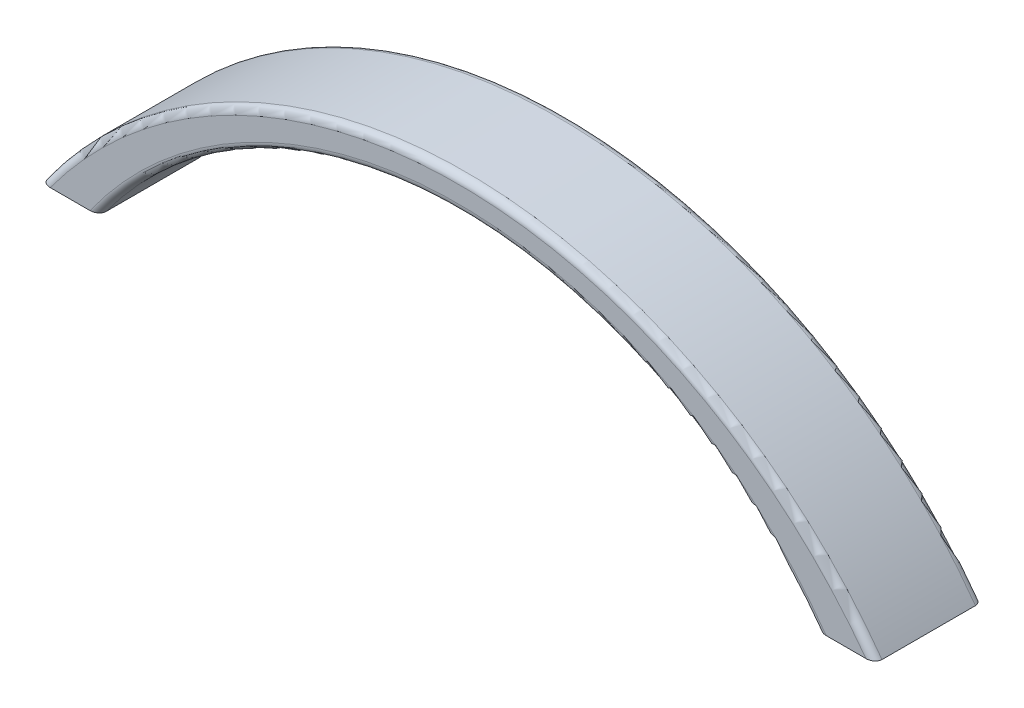
ISO-10303-21;
HEADER;
FILE_DESCRIPTION(('STEP AP214'),'2;1');
FILE_NAME('part.step','',(''),(''),'','','');
FILE_SCHEMA(('AUTOMOTIVE_DESIGN { 1 0 10303 214 1 1 1 1 }'));
ENDSEC;
DATA;
#1=APPLICATION_CONTEXT('core data for automotive mechanical design processes');
#2=APPLICATION_PROTOCOL_DEFINITION('international standard','automotive_design',2000,#1);
#3=PRODUCT_CONTEXT('',#1,'mechanical');
#4=PRODUCT('Part','Part','',(#3));
#5=PRODUCT_RELATED_PRODUCT_CATEGORY('part','',(#4));
#6=PRODUCT_DEFINITION_FORMATION('','',#4);
#7=PRODUCT_DEFINITION_CONTEXT('part definition',#1,'design');
#8=PRODUCT_DEFINITION('design','',#6,#7);
#9=PRODUCT_DEFINITION_SHAPE('','',#8);
#10=(LENGTH_UNIT() NAMED_UNIT(*) SI_UNIT(.MILLI.,.METRE.));
#11=(NAMED_UNIT(*) PLANE_ANGLE_UNIT() SI_UNIT($,.RADIAN.));
#12=(NAMED_UNIT(*) SI_UNIT($,.STERADIAN.) SOLID_ANGLE_UNIT());
#13=UNCERTAINTY_MEASURE_WITH_UNIT(LENGTH_MEASURE(1.E-05),#10,'distance_accuracy_value','');
#14=(GEOMETRIC_REPRESENTATION_CONTEXT(3) GLOBAL_UNCERTAINTY_ASSIGNED_CONTEXT((#13)) GLOBAL_UNIT_ASSIGNED_CONTEXT((#10,
#11,#12)) REPRESENTATION_CONTEXT('',''));
#15=CARTESIAN_POINT('',(0.,0.,0.));
#16=DIRECTION('',(0.,0.,1.));
#17=DIRECTION('',(1.,0.,0.));
#18=AXIS2_PLACEMENT_3D('',#15,#16,#17);
#19=CARTESIAN_POINT('',(0.,-36.3967136150236,15.));
#20=DIRECTION('',(0.,0.,-1.));
#21=DIRECTION('',(-1.,0.,0.));
#22=AXIS2_PLACEMENT_3D('',#19,#20,#21);
#23=CYLINDRICAL_SURFACE('',#22,61.8443268374234);
#24=DIRECTION('',(0.,0.,-1.));
#25=VECTOR('',#24,1.);
#26=CARTESIAN_POINT('',(-50.,0.,15.));
#27=LINE('',#26,#25);
#28=CARTESIAN_POINT('',(-50.,0.,14.));
#29=VERTEX_POINT('',#28);
#30=CARTESIAN_POINT('',(-50.,0.,1.));
#31=VERTEX_POINT('',#30);
#32=EDGE_CURVE('E219',#29,#31,#27,.T.);
#33=ORIENTED_EDGE('',*,*,#32,.T.);
#34=CARTESIAN_POINT('',(0.,-36.3967136150236,1.));
#35=DIRECTION('',(0.,0.,-1.));
#36=DIRECTION('',(-1.,0.,0.));
#37=AXIS2_PLACEMENT_3D('',#34,#35,#36);
#38=CIRCLE('',#37,61.8443268374234);
#39=CARTESIAN_POINT('',(50.,0.,1.));
#40=VERTEX_POINT('',#39);
#41=EDGE_CURVE('E119',#31,#40,#38,.T.);
#42=ORIENTED_EDGE('',*,*,#41,.T.);
#43=DIRECTION('',(0.,0.,-1.));
#44=VECTOR('',#43,1.);
#45=CARTESIAN_POINT('',(50.,0.,15.));
#46=LINE('',#45,#44);
#47=CARTESIAN_POINT('',(50.,0.,14.));
#48=VERTEX_POINT('',#47);
#49=EDGE_CURVE('E103',#48,#40,#46,.T.);
#50=ORIENTED_EDGE('',*,*,#49,.F.);
#51=CARTESIAN_POINT('',(0.,-36.3967136150236,14.));
#52=DIRECTION('',(0.,0.,-1.));
#53=DIRECTION('',(-1.,0.,0.));
#54=AXIS2_PLACEMENT_3D('',#51,#52,#53);
#55=CIRCLE('',#54,61.8443268374234);
#56=EDGE_CURVE('E116',#48,#29,#55,.F.);
#57=ORIENTED_EDGE('',*,*,#56,.T.);
#58=EDGE_LOOP('',(#33,#42,#50,#57));
#59=FACE_BOUND('',#58,.T.);
#60=ADVANCED_FACE('F33',(#59),#23,.F.);
#61=CARTESIAN_POINT('',(50.,0.,15.));
#62=DIRECTION('',(0.,1.,0.));
#63=DIRECTION('',(-1.,0.,0.));
#64=AXIS2_PLACEMENT_3D('',#61,#62,#63);
#65=PLANE('',#64);
#66=ORIENTED_EDGE('',*,*,#49,.T.);
#67=CARTESIAN_POINT('',(50.,0.,1.));
#68=CARTESIAN_POINT('',(49.9999973303354,0.,0.975656117454124));
#69=CARTESIAN_POINT('',(50.0011004083956,0.,0.951325680612658));
#70=CARTESIAN_POINT('',(50.0054817249724,0.,0.902872884445946));
#71=CARTESIAN_POINT('',(50.0087589228829,0.,0.878750431165487));
#72=CARTESIAN_POINT('',(50.0217417247559,0.,0.80724619009343));
#73=CARTESIAN_POINT('',(50.0345996266479,0.,0.760403301098637));
#74=CARTESIAN_POINT('',(50.0679520751676,0.,0.669660913790851));
#75=CARTESIAN_POINT('',(50.0884350861074,0.,0.625757086877651));
#76=CARTESIAN_POINT('',(50.1360216281653,0.,0.541655603501701));
#77=CARTESIAN_POINT('',(50.1631335109511,0.,0.501462711113891));
#78=CARTESIAN_POINT('',(50.2249309833848,0.,0.422778706721437));
#79=CARTESIAN_POINT('',(50.2600120677553,0.,0.384600162044744));
#80=CARTESIAN_POINT('',(50.3351768897337,0.,0.313576106327075));
#81=CARTESIAN_POINT('',(50.3752618565199,0.,0.280731910218845));
#82=CARTESIAN_POINT('',(50.467026549603,0.,0.214992146734737));
#83=CARTESIAN_POINT('',(50.5194859604133,0.,0.183186128162649));
#84=CARTESIAN_POINT('',(50.6283551876696,0.,0.127211462005206));
#85=CARTESIAN_POINT('',(50.684769337654,0.,0.103051357676763));
#86=CARTESIAN_POINT('',(50.8111668957454,0.,0.0584711953695335));
#87=CARTESIAN_POINT('',(50.8817024755066,0.,0.0396164530205002));
#88=CARTESIAN_POINT('',(51.0246834154305,0.,0.0125232794636211));
#89=CARTESIAN_POINT('',(51.0971259681558,0.,0.0042700449595866));
#90=CARTESIAN_POINT('',(51.1903798190438,0.,0.000425739631521767));
#91=CARTESIAN_POINT('',(51.2110511926059,0.,1.21973844565116E-07));
#92=CARTESIAN_POINT('',(51.2317153106828,0.,0.));
#93=B_SPLINE_CURVE_WITH_KNOTS('',3,(#67,#68,#69,#70,#71,#72,#73,#74,#75,#76,#77,#78,#79,#80,#81,
#82,#83,#84,#85,#86,#87,#88,#89,#90,#91,#92),.UNSPECIFIED.,.F.,.F.,(4,2,2,2,2,2,2,2,2,2,2,2,4),
(0.,0.0729807791682395,0.145926652486109,0.290859667092715,0.435574304215737,0.580472214365173,
0.735443548170114,0.890453025078733,1.07381667770554,1.25738449644889,1.47558133069051,
1.69347315585304,1.75548084937669),.UNSPECIFIED.);
#94=CARTESIAN_POINT('',(51.2317153106828,0.,0.));
#95=VERTEX_POINT('',#94);
#96=EDGE_CURVE('E110',#40,#95,#93,.T.);
#97=ORIENTED_EDGE('',*,*,#96,.T.);
#98=DIRECTION('',(1.,0.,0.));
#99=VECTOR('',#98,1.);
#100=CARTESIAN_POINT('',(50.,0.,0.));
#101=LINE('',#100,#99);
#102=CARTESIAN_POINT('',(56.7657879567442,0.,0.));
#103=VERTEX_POINT('',#102);
#104=EDGE_CURVE('E199',#95,#103,#101,.T.);
#105=ORIENTED_EDGE('',*,*,#104,.T.);
#106=CARTESIAN_POINT('',(56.7657879567442,0.,0.));
#107=CARTESIAN_POINT('',(56.8503936718824,0.,1.87937669883942E-05));
#108=CARTESIAN_POINT('',(56.9351617328932,0.,0.00700431566945534));
#109=CARTESIAN_POINT('',(57.1027645540088,0.,0.0352733980871163));
#110=CARTESIAN_POINT('',(57.1855852603745,0.,0.0566395985893962));
#111=CARTESIAN_POINT('',(57.3318141922752,0.,0.108968350539189));
#112=CARTESIAN_POINT('',(57.3960661303273,0.,0.137567119214284));
#113=CARTESIAN_POINT('',(57.5189433983722,0.,0.204830031545095));
#114=CARTESIAN_POINT('',(57.5775835800715,0.,0.243466541837695));
#115=CARTESIAN_POINT('',(57.6769651245512,0.,0.322791148161954));
#116=CARTESIAN_POINT('',(57.7190220972949,0.,0.361828038141967));
#117=CARTESIAN_POINT('',(57.7962254955942,0.,0.44631668782979));
#118=CARTESIAN_POINT('',(57.8313705389152,0.,0.49176972751165));
#119=CARTESIAN_POINT('',(57.8931837161221,0.,0.588728915541138));
#120=CARTESIAN_POINT('',(57.9197751107167,0.,0.640284476607118));
#121=CARTESIAN_POINT('',(57.9621894882547,0.,0.747611083078497));
#122=CARTESIAN_POINT('',(57.9780397464968,0.,0.803371048493074));
#123=CARTESIAN_POINT('',(57.9919221854008,0.,0.883190223559995));
#124=CARTESIAN_POINT('',(57.9949472283301,0.,0.906456659470983));
#125=CARTESIAN_POINT('',(57.9989852341919,0.,0.953143520093479));
#126=CARTESIAN_POINT('',(57.9999998961424,0.,0.976563797978172));
#127=CARTESIAN_POINT('',(58.0000000000002,0.,0.999999999999966));
#128=B_SPLINE_CURVE_WITH_KNOTS('',3,(#106,#107,#108,#109,#110,#111,#112,#113,#114,#115,#116,
#117,#118,#119,#120,#121,#122,#123,#124,#125,#126,#127),.UNSPECIFIED.,.F.,.F.,(4,2,2,2,2,2,2,2,
2,2,4),(0.,0.253811426040733,0.509094000667615,0.719253361415208,0.928840184863864,
1.10030794301184,1.27180995616909,1.44481026414552,1.61736960422303,1.68768458782042,
1.75794012126249),.UNSPECIFIED.);
#129=CARTESIAN_POINT('',(58.,0.,1.));
#130=VERTEX_POINT('',#129);
#131=EDGE_CURVE('E126',#103,#130,#128,.T.);
#132=ORIENTED_EDGE('',*,*,#131,.T.);
#133=DIRECTION('',(0.,0.,-1.));
#134=VECTOR('',#133,1.);
#135=CARTESIAN_POINT('',(58.,0.,15.));
#136=LINE('',#135,#134);
#137=CARTESIAN_POINT('',(58.,0.,14.));
#138=VERTEX_POINT('',#137);
#139=EDGE_CURVE('E120',#138,#130,#136,.T.);
#140=ORIENTED_EDGE('',*,*,#139,.F.);
#141=CARTESIAN_POINT('',(58.,0.,14.));
#142=CARTESIAN_POINT('',(58.0000024957816,0.,14.0243981111237));
#143=CARTESIAN_POINT('',(57.9989011111455,0.,14.0487828593716));
#144=CARTESIAN_POINT('',(57.9945254144109,0.,14.0973457507056));
#145=CARTESIAN_POINT('',(57.9912520868181,0.,14.1215239823751));
#146=CARTESIAN_POINT('',(57.9782801366165,0.,14.1932071805878));
#147=CARTESIAN_POINT('',(57.965428532261,0.,14.2401752713859));
#148=CARTESIAN_POINT('',(57.9320648299265,0.,14.331173475095));
#149=CARTESIAN_POINT('',(57.911563432169,0.,14.3752075910077));
#150=CARTESIAN_POINT('',(57.8639002545474,0.,14.4595489259985));
#151=CARTESIAN_POINT('',(57.836730563888,0.,14.4998516396148));
#152=CARTESIAN_POINT('',(57.7748576369759,0.,14.5786068495586));
#153=CARTESIAN_POINT('',(57.7397737829439,0.,14.6167584671568));
#154=CARTESIAN_POINT('',(57.6645835485815,0.,14.6877011674781));
#155=CARTESIAN_POINT('',(57.6244758695179,0.,14.7204908589921));
#156=CARTESIAN_POINT('',(57.5328724780517,0.,14.7859179748109));
#157=CARTESIAN_POINT('',(57.4806194413512,0.,14.8174936017386));
#158=CARTESIAN_POINT('',(57.372200502489,0.,14.8730462013864));
#159=CARTESIAN_POINT('',(57.3160304786872,0.,14.8970150180875));
#160=CARTESIAN_POINT('',(57.1901150383225,0.,14.9412908848248));
#161=CARTESIAN_POINT('',(57.1198198943557,0.,14.9600338726636));
#162=CARTESIAN_POINT('',(56.9773446078093,0.,14.9870659729169));
#163=CARTESIAN_POINT('',(56.9051669360278,0.,14.9953681471921));
#164=CARTESIAN_POINT('',(56.8104865501841,0.,14.9995118239268));
#165=CARTESIAN_POINT('',(56.7881330501687,0.,14.9999997393034));
#166=CARTESIAN_POINT('',(56.7657879567442,0.,15.));
#167=B_SPLINE_CURVE_WITH_KNOTS('',3,(#141,#142,#143,#144,#145,#146,#147,#148,#149,#150,#151,
#152,#153,#154,#155,#156,#157,#158,#159,#160,#161,#162,#163,#164,#165,#166),.UNSPECIFIED.,.F.,
.F.,(4,2,2,2,2,2,2,2,2,2,2,2,4),(0.,0.0731437106474338,0.146254289094091,0.291545015560752,
0.436633272456196,0.58189449100049,0.736807733499723,0.891761106340413,1.07424089685055,
1.25691568623389,1.47434232870997,1.69149669059638,1.75854908127019),.UNSPECIFIED.);
#168=CARTESIAN_POINT('',(56.7657879567442,0.,15.));
#169=VERTEX_POINT('',#168);
#170=EDGE_CURVE('E111',#138,#169,#167,.T.);
#171=ORIENTED_EDGE('',*,*,#170,.T.);
#172=DIRECTION('',(1.,0.,0.));
#173=VECTOR('',#172,1.);
#174=CARTESIAN_POINT('',(50.,0.,15.));
#175=LINE('',#174,#173);
#176=CARTESIAN_POINT('',(51.2317153106828,0.,15.));
#177=VERTEX_POINT('',#176);
#178=EDGE_CURVE('E105',#177,#169,#175,.T.);
#179=ORIENTED_EDGE('',*,*,#178,.F.);
#180=CARTESIAN_POINT('',(51.2317153106828,0.,15.));
#181=CARTESIAN_POINT('',(51.1472236883556,0.,14.999973466267));
#182=CARTESIAN_POINT('',(51.0626200874483,0.,14.9928761746944));
#183=CARTESIAN_POINT('',(50.8950194191518,0.,14.9642308407041));
#184=CARTESIAN_POINT('',(50.8120476790812,0.,14.9425355450203));
#185=CARTESIAN_POINT('',(50.6534102670616,0.,14.8851111313371));
#186=CARTESIAN_POINT('',(50.5776130579853,0.,14.8497499984091));
#187=CARTESIAN_POINT('',(50.4346466886132,0.,14.7649240018536));
#188=CARTESIAN_POINT('',(50.3674362324553,0.,14.7155306337727));
#189=CARTESIAN_POINT('',(50.2662832005474,0.,14.6220782699038));
#190=CARTESIAN_POINT('',(50.2287734834122,0.,14.5818568705326));
#191=CARTESIAN_POINT('',(50.1607739071946,0.,14.4957763455835));
#192=CARTESIAN_POINT('',(50.1302847204631,0.,14.4499166806779));
#193=CARTESIAN_POINT('',(50.0777683356424,0.,14.3530506827985));
#194=CARTESIAN_POINT('',(50.0558134656006,0.,14.302004795106));
#195=CARTESIAN_POINT('',(50.0223010163142,0.,14.1966546223326));
#196=CARTESIAN_POINT('',(50.0107150137348,0.,14.1423596827835));
#197=CARTESIAN_POINT('',(50.0031668381868,0.,14.0730099549821));
#198=CARTESIAN_POINT('',(50.0019794579007,0.,14.0584237078899));
#199=CARTESIAN_POINT('',(50.0003973349641,0.,14.0292273965754));
#200=CARTESIAN_POINT('',(50.0000015576974,0.,14.0146173884514));
#201=CARTESIAN_POINT('',(50.,0.,14.));
#202=B_SPLINE_CURVE_WITH_KNOTS('',3,(#180,#181,#182,#183,#184,#185,#186,#187,#188,#189,#190,
#191,#192,#193,#194,#195,#196,#197,#198,#199,#200,#201),.UNSPECIFIED.,.F.,.F.,(4,2,2,2,2,2,2,2,
2,2,4),(0.,0.253371728164806,0.509338368627763,0.758845252921335,1.00710300014542,
1.17146982191672,1.33585237843354,1.50159918445529,1.6668902380685,1.7107797377657,
1.75461183679463),.UNSPECIFIED.);
#203=EDGE_CURVE('E100',#177,#48,#202,.T.);
#204=ORIENTED_EDGE('',*,*,#203,.T.);
#205=EDGE_LOOP('',(#66,#97,#105,#132,#140,#171,#179,#204));
#206=FACE_BOUND('',#205,.T.);
#207=ADVANCED_FACE('F102',(#206),#65,.F.);
#208=CARTESIAN_POINT('',(0.,-41.5080915227887,15.));
#209=DIRECTION('',(0.,0.,-1.));
#210=DIRECTION('',(-1.,0.,0.));
#211=AXIS2_PLACEMENT_3D('',#208,#209,#210);
#212=CYLINDRICAL_SURFACE('',#211,71.3226588249779);
#213=DIRECTION('',(0.,0.,-1.));
#214=VECTOR('',#213,1.);
#215=CARTESIAN_POINT('',(-58.,0.,15.));
#216=LINE('',#215,#214);
#217=CARTESIAN_POINT('',(-58.,0.,14.));
#218=VERTEX_POINT('',#217);
#219=CARTESIAN_POINT('',(-58.,0.,1.));
#220=VERTEX_POINT('',#219);
#221=EDGE_CURVE('E216',#218,#220,#216,.T.);
#222=ORIENTED_EDGE('',*,*,#221,.F.);
#223=CARTESIAN_POINT('',(0.,-41.5080915227887,14.));
#224=DIRECTION('',(0.,0.,-1.));
#225=DIRECTION('',(-1.,0.,0.));
#226=AXIS2_PLACEMENT_3D('',#223,#224,#225);
#227=CIRCLE('',#226,71.3226588249779);
#228=EDGE_CURVE('E11',#218,#138,#227,.T.);
#229=ORIENTED_EDGE('',*,*,#228,.T.);
#230=ORIENTED_EDGE('',*,*,#139,.T.);
#231=CARTESIAN_POINT('',(0.,-41.5080915227887,1.));
#232=DIRECTION('',(0.,0.,-1.));
#233=DIRECTION('',(-1.,0.,0.));
#234=AXIS2_PLACEMENT_3D('',#231,#232,#233);
#235=CIRCLE('',#234,71.3226588249779);
#236=EDGE_CURVE('E42',#130,#220,#235,.F.);
#237=ORIENTED_EDGE('',*,*,#236,.T.);
#238=EDGE_LOOP('',(#222,#229,#230,#237));
#239=FACE_BOUND('',#238,.T.);
#240=ADVANCED_FACE('F142',(#239),#212,.T.);
#241=CARTESIAN_POINT('',(-50.,0.,15.));
#242=DIRECTION('',(0.,1.,0.));
#243=DIRECTION('',(-1.,0.,0.));
#244=AXIS2_PLACEMENT_3D('',#241,#242,#243);
#245=PLANE('',#244);
#246=DIRECTION('',(1.,0.,0.));
#247=VECTOR('',#246,1.);
#248=CARTESIAN_POINT('',(-50.,0.,0.));
#249=LINE('',#248,#247);
#250=CARTESIAN_POINT('',(-56.7657879567442,0.,0.));
#251=VERTEX_POINT('',#250);
#252=CARTESIAN_POINT('',(-51.2317153106828,0.,0.));
#253=VERTEX_POINT('',#252);
#254=EDGE_CURVE('E204',#251,#253,#249,.T.);
#255=ORIENTED_EDGE('',*,*,#254,.T.);
#256=CARTESIAN_POINT('',(-51.2317153106828,0.,0.));
#257=CARTESIAN_POINT('',(-51.1472236883556,0.,2.6533733044161E-05));
#258=CARTESIAN_POINT('',(-51.0626200874483,0.,0.00712382530559565));
#259=CARTESIAN_POINT('',(-50.8950194191518,0.,0.0357691592958746));
#260=CARTESIAN_POINT('',(-50.8120476790812,0.,0.0574644549796923));
#261=CARTESIAN_POINT('',(-50.6534102670616,0.,0.114888868662945));
#262=CARTESIAN_POINT('',(-50.5776130579853,0.,0.150250001590914));
#263=CARTESIAN_POINT('',(-50.4346466886132,0.,0.23507599814639));
#264=CARTESIAN_POINT('',(-50.3674362324553,0.,0.284469366227326));
#265=CARTESIAN_POINT('',(-50.2662832005474,0.,0.377921730096184));
#266=CARTESIAN_POINT('',(-50.2287734834122,0.,0.418143129467396));
#267=CARTESIAN_POINT('',(-50.1607739071946,0.,0.504223654416453));
#268=CARTESIAN_POINT('',(-50.1302847204631,0.,0.550083319322136));
#269=CARTESIAN_POINT('',(-50.0777683356424,0.,0.64694931720148));
#270=CARTESIAN_POINT('',(-50.0558134656006,0.,0.697995204893961));
#271=CARTESIAN_POINT('',(-50.0223010163142,0.,0.803345377667363));
#272=CARTESIAN_POINT('',(-50.0107150137348,0.,0.857640317216501));
#273=CARTESIAN_POINT('',(-50.0031668381868,0.,0.926990045017895));
#274=CARTESIAN_POINT('',(-50.0019794579007,0.,0.9415762921101));
#275=CARTESIAN_POINT('',(-50.0003973349641,0.,0.970772603424584));
#276=CARTESIAN_POINT('',(-50.0000015576974,0.,0.985382611548569));
#277=CARTESIAN_POINT('',(-50.,0.,1.));
#278=B_SPLINE_CURVE_WITH_KNOTS('',3,(#256,#257,#258,#259,#260,#261,#262,#263,#264,#265,#266,
#267,#268,#269,#270,#271,#272,#273,#274,#275,#276,#277),.UNSPECIFIED.,.F.,.F.,(4,2,2,2,2,2,2,2,
2,2,4),(0.,0.253371728164805,0.509338368627763,0.758845252921335,1.00710300014542,
1.17146982191672,1.33585237843354,1.50159918445529,1.6668902380685,1.7107797377657,
1.75461183679464),.UNSPECIFIED.);
#279=EDGE_CURVE('E170',#253,#31,#278,.T.);
#280=ORIENTED_EDGE('',*,*,#279,.T.);
#281=ORIENTED_EDGE('',*,*,#32,.F.);
#282=CARTESIAN_POINT('',(-50.,0.,14.));
#283=CARTESIAN_POINT('',(-49.9999973303354,0.,14.0243438825459));
#284=CARTESIAN_POINT('',(-50.0011004083956,0.,14.0486743193873));
#285=CARTESIAN_POINT('',(-50.0054817249724,0.,14.0971271155541));
#286=CARTESIAN_POINT('',(-50.0087589228829,0.,14.1212495688345));
#287=CARTESIAN_POINT('',(-50.0217417247559,0.,14.1927538099066));
#288=CARTESIAN_POINT('',(-50.0345996266479,0.,14.2395966989014));
#289=CARTESIAN_POINT('',(-50.0679520751676,0.,14.3303390862091));
#290=CARTESIAN_POINT('',(-50.0884350861074,0.,14.3742429131223));
#291=CARTESIAN_POINT('',(-50.1360216281653,0.,14.4583443964983));
#292=CARTESIAN_POINT('',(-50.1631335109511,0.,14.4985372888861));
#293=CARTESIAN_POINT('',(-50.2249309833848,0.,14.5772212932786));
#294=CARTESIAN_POINT('',(-50.2600120677553,0.,14.6153998379553));
#295=CARTESIAN_POINT('',(-50.3351768897337,0.,14.6864238936729));
#296=CARTESIAN_POINT('',(-50.3752618565199,0.,14.7192680897812));
#297=CARTESIAN_POINT('',(-50.467026549603,0.,14.7850078532653));
#298=CARTESIAN_POINT('',(-50.5194859604133,0.,14.8168138718374));
#299=CARTESIAN_POINT('',(-50.6283551876696,0.,14.8727885379948));
#300=CARTESIAN_POINT('',(-50.684769337654,0.,14.8969486423232));
#301=CARTESIAN_POINT('',(-50.8111668957454,0.,14.9415288046305));
#302=CARTESIAN_POINT('',(-50.8817024755066,0.,14.9603835469795));
#303=CARTESIAN_POINT('',(-51.0246834154305,0.,14.9874767205364));
#304=CARTESIAN_POINT('',(-51.0971259681557,0.,14.9957299550404));
#305=CARTESIAN_POINT('',(-51.1903798190437,0.,14.9995742603685));
#306=CARTESIAN_POINT('',(-51.2110511926059,0.,14.9999998780262));
#307=CARTESIAN_POINT('',(-51.2317153106828,0.,15.));
#308=B_SPLINE_CURVE_WITH_KNOTS('',3,(#282,#283,#284,#285,#286,#287,#288,#289,#290,#291,#292,
#293,#294,#295,#296,#297,#298,#299,#300,#301,#302,#303,#304,#305,#306,#307),.UNSPECIFIED.,.F.,
.F.,(4,2,2,2,2,2,2,2,2,2,2,2,4),(0.,0.0729807791682394,0.14592665248611,0.290859667092716,
0.435574304215737,0.580472214365175,0.735443548170115,0.890453025078728,1.07381667770555,
1.25738449644889,1.47558133069051,1.69347315585303,1.75548084937669),.UNSPECIFIED.);
#309=CARTESIAN_POINT('',(-51.2317153106828,0.,15.));
#310=VERTEX_POINT('',#309);
#311=EDGE_CURVE('E124',#29,#310,#308,.T.);
#312=ORIENTED_EDGE('',*,*,#311,.T.);
#313=DIRECTION('',(1.,0.,0.));
#314=VECTOR('',#313,1.);
#315=CARTESIAN_POINT('',(-50.,0.,15.));
#316=LINE('',#315,#314);
#317=CARTESIAN_POINT('',(-56.7657879567442,0.,15.));
#318=VERTEX_POINT('',#317);
#319=EDGE_CURVE('E221',#318,#310,#316,.T.);
#320=ORIENTED_EDGE('',*,*,#319,.F.);
#321=CARTESIAN_POINT('',(-56.7657879567442,0.,15.));
#322=CARTESIAN_POINT('',(-56.8503936718824,0.,14.999981206233));
#323=CARTESIAN_POINT('',(-56.9351617328932,0.,14.9929956843305));
#324=CARTESIAN_POINT('',(-57.1027645540088,0.,14.9647266019129));
#325=CARTESIAN_POINT('',(-57.1855852603745,0.,14.9433604014106));
#326=CARTESIAN_POINT('',(-57.3318141922752,0.,14.8910316494608));
#327=CARTESIAN_POINT('',(-57.3960661303273,0.,14.8624328807857));
#328=CARTESIAN_POINT('',(-57.5189433983722,0.,14.7951699684549));
#329=CARTESIAN_POINT('',(-57.5775835800715,0.,14.7565334581623));
#330=CARTESIAN_POINT('',(-57.6769651245512,0.,14.677208851838));
#331=CARTESIAN_POINT('',(-57.7190220972949,0.,14.638171961858));
#332=CARTESIAN_POINT('',(-57.7962254955942,0.,14.5536833121702));
#333=CARTESIAN_POINT('',(-57.8313705389152,0.,14.5082302724883));
#334=CARTESIAN_POINT('',(-57.8931837161221,0.,14.4112710844589));
#335=CARTESIAN_POINT('',(-57.9197751107167,0.,14.3597155233929));
#336=CARTESIAN_POINT('',(-57.9621894882547,0.,14.2523889169215));
#337=CARTESIAN_POINT('',(-57.9780397464968,0.,14.1966289515069));
#338=CARTESIAN_POINT('',(-57.9919221854008,0.,14.11680977644));
#339=CARTESIAN_POINT('',(-57.9949472283301,0.,14.093543340529));
#340=CARTESIAN_POINT('',(-57.9989852341919,0.,14.0468564799065));
#341=CARTESIAN_POINT('',(-57.9999998961424,0.,14.0234362020218));
#342=CARTESIAN_POINT('',(-58.0000000000002,0.,14.));
#343=B_SPLINE_CURVE_WITH_KNOTS('',3,(#321,#322,#323,#324,#325,#326,#327,#328,#329,#330,#331,
#332,#333,#334,#335,#336,#337,#338,#339,#340,#341,#342),.UNSPECIFIED.,.F.,.F.,(4,2,2,2,2,2,2,2,
2,2,4),(0.,0.253811426040733,0.509094000667615,0.719253361415208,0.928840184863865,
1.10030794301184,1.27180995616909,1.44481026414552,1.61736960422303,1.68768458782041,
1.75794012126249),.UNSPECIFIED.);
#344=EDGE_CURVE('E57',#318,#218,#343,.T.);
#345=ORIENTED_EDGE('',*,*,#344,.T.);
#346=ORIENTED_EDGE('',*,*,#221,.T.);
#347=CARTESIAN_POINT('',(-58.,0.,1.));
#348=CARTESIAN_POINT('',(-58.0000024957816,0.,0.975601888876293));
#349=CARTESIAN_POINT('',(-57.9989011111455,0.,0.951217140628419));
#350=CARTESIAN_POINT('',(-57.9945254144109,0.,0.902654249294392));
#351=CARTESIAN_POINT('',(-57.9912520868181,0.,0.878476017624863));
#352=CARTESIAN_POINT('',(-57.9782801366165,0.,0.806792819412159));
#353=CARTESIAN_POINT('',(-57.965428532261,0.,0.759824728614051));
#354=CARTESIAN_POINT('',(-57.9320648299265,0.,0.668826524904996));
#355=CARTESIAN_POINT('',(-57.9115634321691,0.,0.624792408992326));
#356=CARTESIAN_POINT('',(-57.8639002545474,0.,0.540451074001488));
#357=CARTESIAN_POINT('',(-57.836730563888,0.,0.500148360385203));
#358=CARTESIAN_POINT('',(-57.7748576369759,0.,0.421393150441442));
#359=CARTESIAN_POINT('',(-57.7397737829439,0.,0.383241532843203));
#360=CARTESIAN_POINT('',(-57.6645835485815,0.,0.312298832521895));
#361=CARTESIAN_POINT('',(-57.6244758695179,0.,0.279509141007915));
#362=CARTESIAN_POINT('',(-57.5328724780517,0.,0.214082025189067));
#363=CARTESIAN_POINT('',(-57.4806194413512,0.,0.182506398261373));
#364=CARTESIAN_POINT('',(-57.372200502489,0.,0.126953798613612));
#365=CARTESIAN_POINT('',(-57.3160304786872,0.,0.102984981912539));
#366=CARTESIAN_POINT('',(-57.1901150383225,0.,0.0587091151751995));
#367=CARTESIAN_POINT('',(-57.1198198943557,0.,0.0399661273364307));
#368=CARTESIAN_POINT('',(-56.9773446078093,0.,0.0129340270830856));
#369=CARTESIAN_POINT('',(-56.9051669360278,0.,0.00463185280787061));
#370=CARTESIAN_POINT('',(-56.8104865501841,0.,0.000488176073177815));
#371=CARTESIAN_POINT('',(-56.7881330501687,0.,2.60696648691773E-07));
#372=CARTESIAN_POINT('',(-56.7657879567442,0.,0.));
#373=B_SPLINE_CURVE_WITH_KNOTS('',3,(#347,#348,#349,#350,#351,#352,#353,#354,#355,#356,#357,
#358,#359,#360,#361,#362,#363,#364,#365,#366,#367,#368,#369,#370,#371,#372),.UNSPECIFIED.,.F.,
.F.,(4,2,2,2,2,2,2,2,2,2,2,2,4),(0.,0.0731437106474323,0.146254289094089,0.291545015560749,
0.436633272456191,0.58189449100049,0.736807733499727,0.891761106340416,1.07424089685055,
1.25691568623388,1.47434232870997,1.69149669059637,1.75854908127019),.UNSPECIFIED.);
#374=EDGE_CURVE('E49',#220,#251,#373,.T.);
#375=ORIENTED_EDGE('',*,*,#374,.T.);
#376=EDGE_LOOP('',(#255,#280,#281,#312,#320,#345,#346,#375));
#377=FACE_BOUND('',#376,.T.);
#378=ADVANCED_FACE('F179',(#377),#245,.F.);
#379=CARTESIAN_POINT('',(0.,-36.3967136150236,15.));
#380=DIRECTION('',(0.,0.,-1.));
#381=DIRECTION('',(-1.,0.,0.));
#382=AXIS2_PLACEMENT_3D('',#379,#380,#381);
#383=PLANE('',#382);
#384=ORIENTED_EDGE('',*,*,#319,.T.);
#385=CARTESIAN_POINT('',(0.,-36.3967136150236,15.));
#386=DIRECTION('',(0.,0.,-1.));
#387=DIRECTION('',(-1.,0.,0.));
#388=AXIS2_PLACEMENT_3D('',#385,#386,#387);
#389=CIRCLE('',#388,62.8443268374234);
#390=EDGE_CURVE('E209',#310,#177,#389,.T.);
#391=ORIENTED_EDGE('',*,*,#390,.T.);
#392=ORIENTED_EDGE('',*,*,#178,.T.);
#393=CARTESIAN_POINT('',(0.,-41.5080915227887,15.));
#394=DIRECTION('',(0.,0.,-1.));
#395=DIRECTION('',(-1.,0.,0.));
#396=AXIS2_PLACEMENT_3D('',#393,#394,#395);
#397=CIRCLE('',#396,70.3226588249779);
#398=EDGE_CURVE('E207',#169,#318,#397,.F.);
#399=ORIENTED_EDGE('',*,*,#398,.T.);
#400=EDGE_LOOP('',(#384,#391,#392,#399));
#401=FACE_BOUND('',#400,.T.);
#402=ADVANCED_FACE('F183',(#401),#383,.F.);
#403=CARTESIAN_POINT('',(0.,-36.3967136150236,0.));
#404=DIRECTION('',(0.,0.,-1.));
#405=DIRECTION('',(-1.,0.,0.));
#406=AXIS2_PLACEMENT_3D('',#403,#404,#405);
#407=PLANE('',#406);
#408=ORIENTED_EDGE('',*,*,#104,.F.);
#409=CARTESIAN_POINT('',(0.,-36.3967136150236,0.));
#410=DIRECTION('',(0.,0.,-1.));
#411=DIRECTION('',(-1.,0.,0.));
#412=AXIS2_PLACEMENT_3D('',#409,#410,#411);
#413=CIRCLE('',#412,62.8443268374234);
#414=EDGE_CURVE('E193',#95,#253,#413,.F.);
#415=ORIENTED_EDGE('',*,*,#414,.T.);
#416=ORIENTED_EDGE('',*,*,#254,.F.);
#417=CARTESIAN_POINT('',(0.,-41.5080915227887,0.));
#418=DIRECTION('',(0.,0.,-1.));
#419=DIRECTION('',(-1.,0.,0.));
#420=AXIS2_PLACEMENT_3D('',#417,#418,#419);
#421=CIRCLE('',#420,70.3226588249779);
#422=EDGE_CURVE('E194',#251,#103,#421,.T.);
#423=ORIENTED_EDGE('',*,*,#422,.T.);
#424=EDGE_LOOP('',(#408,#415,#416,#423));
#425=FACE_BOUND('',#424,.T.);
#426=ADVANCED_FACE('F184',(#425),#407,.T.);
#427=CARTESIAN_POINT('',(0.,-36.3967136150236,1.));
#428=DIRECTION('',(0.,0.,-1.));
#429=DIRECTION('',(-1.,0.,0.));
#430=AXIS2_PLACEMENT_3D('',#427,#428,#429);
#431=TOROIDAL_SURFACE('',#430,62.8443268374234,1.);
#432=ORIENTED_EDGE('',*,*,#279,.F.);
#433=ORIENTED_EDGE('',*,*,#414,.F.);
#434=ORIENTED_EDGE('',*,*,#96,.F.);
#435=ORIENTED_EDGE('',*,*,#41,.F.);
#436=EDGE_LOOP('',(#432,#433,#434,#435));
#437=FACE_BOUND('',#436,.T.);
#438=ADVANCED_FACE('F160',(#437),#431,.T.);
#439=CARTESIAN_POINT('',(0.,-36.3967136150236,14.));
#440=DIRECTION('',(0.,0.,-1.));
#441=DIRECTION('',(-1.,0.,0.));
#442=AXIS2_PLACEMENT_3D('',#439,#440,#441);
#443=TOROIDAL_SURFACE('',#442,62.8443268374234,1.);
#444=ORIENTED_EDGE('',*,*,#311,.F.);
#445=ORIENTED_EDGE('',*,*,#56,.F.);
#446=ORIENTED_EDGE('',*,*,#203,.F.);
#447=ORIENTED_EDGE('',*,*,#390,.F.);
#448=EDGE_LOOP('',(#444,#445,#446,#447));
#449=FACE_BOUND('',#448,.T.);
#450=ADVANCED_FACE('F123',(#449),#443,.T.);
#451=CARTESIAN_POINT('',(0.,-41.5080915227887,14.));
#452=DIRECTION('',(0.,0.,-1.));
#453=DIRECTION('',(-1.,0.,0.));
#454=AXIS2_PLACEMENT_3D('',#451,#452,#453);
#455=TOROIDAL_SURFACE('',#454,70.3226588249779,1.);
#456=ORIENTED_EDGE('',*,*,#170,.F.);
#457=ORIENTED_EDGE('',*,*,#228,.F.);
#458=ORIENTED_EDGE('',*,*,#344,.F.);
#459=ORIENTED_EDGE('',*,*,#398,.F.);
#460=EDGE_LOOP('',(#456,#457,#458,#459));
#461=FACE_BOUND('',#460,.T.);
#462=ADVANCED_FACE('F159',(#461),#455,.T.);
#463=CARTESIAN_POINT('',(0.,-41.5080915227887,1.));
#464=DIRECTION('',(0.,0.,-1.));
#465=DIRECTION('',(-1.,0.,0.));
#466=AXIS2_PLACEMENT_3D('',#463,#464,#465);
#467=TOROIDAL_SURFACE('',#466,70.3226588249779,1.);
#468=ORIENTED_EDGE('',*,*,#131,.F.);
#469=ORIENTED_EDGE('',*,*,#422,.F.);
#470=ORIENTED_EDGE('',*,*,#374,.F.);
#471=ORIENTED_EDGE('',*,*,#236,.F.);
#472=EDGE_LOOP('',(#468,#469,#470,#471));
#473=FACE_BOUND('',#472,.T.);
#474=ADVANCED_FACE('F35',(#473),#467,.T.);
#475=CLOSED_SHELL('',(#60,#207,#240,#378,#402,#426,#438,#450,#462,#474));
#476=MANIFOLD_SOLID_BREP('B2',#475);
#477=ADVANCED_BREP_SHAPE_REPRESENTATION('',(#18,#476),#14);
#478=SHAPE_DEFINITION_REPRESENTATION(#9,#477);
ENDSEC;
END-ISO-10303-21;
